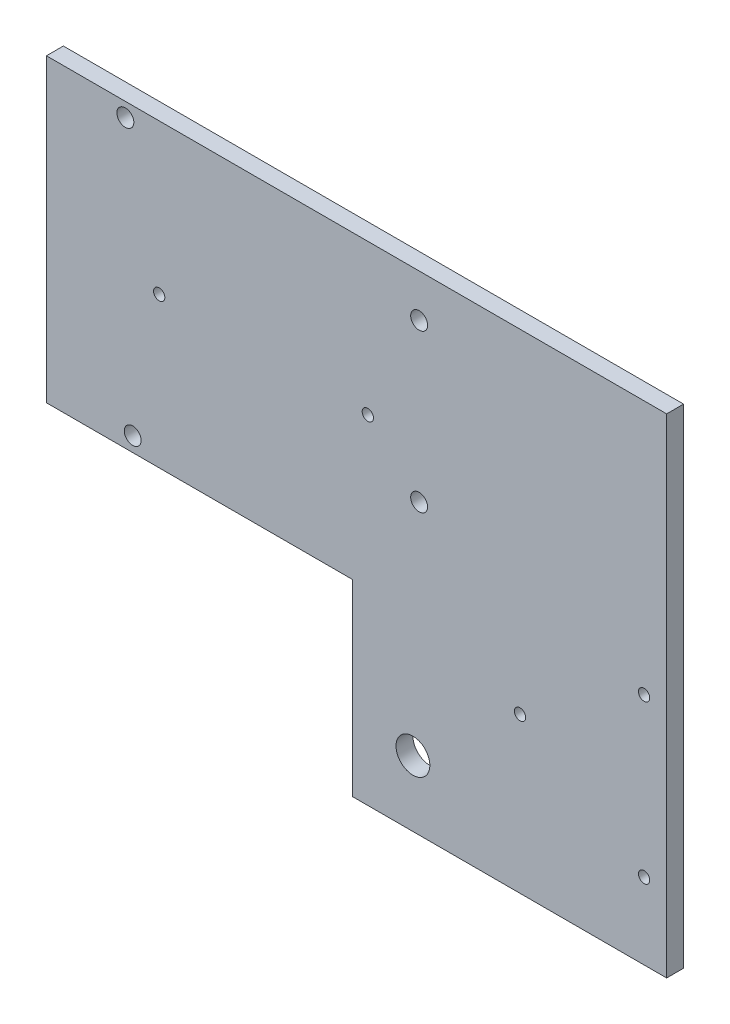
ISO-10303-21;
HEADER;
FILE_DESCRIPTION(('STEP AP214'),'2;1');
FILE_NAME('part.step','',(''),(''),'','','');
FILE_SCHEMA(('AUTOMOTIVE_DESIGN { 1 0 10303 214 1 1 1 1 }'));
ENDSEC;
DATA;
#1=APPLICATION_CONTEXT('core data for automotive mechanical design processes');
#2=APPLICATION_PROTOCOL_DEFINITION('international standard','automotive_design',2000,#1);
#3=PRODUCT_CONTEXT('',#1,'mechanical');
#4=PRODUCT('Part','Part','',(#3));
#5=PRODUCT_RELATED_PRODUCT_CATEGORY('part','',(#4));
#6=PRODUCT_DEFINITION_FORMATION('','',#4);
#7=PRODUCT_DEFINITION_CONTEXT('part definition',#1,'design');
#8=PRODUCT_DEFINITION('design','',#6,#7);
#9=PRODUCT_DEFINITION_SHAPE('','',#8);
#10=(LENGTH_UNIT() NAMED_UNIT(*) SI_UNIT(.MILLI.,.METRE.));
#11=(NAMED_UNIT(*) PLANE_ANGLE_UNIT() SI_UNIT($,.RADIAN.));
#12=(NAMED_UNIT(*) SI_UNIT($,.STERADIAN.) SOLID_ANGLE_UNIT());
#13=UNCERTAINTY_MEASURE_WITH_UNIT(LENGTH_MEASURE(1.E-05),#10,'distance_accuracy_value','');
#14=(GEOMETRIC_REPRESENTATION_CONTEXT(3) GLOBAL_UNCERTAINTY_ASSIGNED_CONTEXT((#13)) GLOBAL_UNIT_ASSIGNED_CONTEXT((#10,
#11,#12)) REPRESENTATION_CONTEXT('',''));
#15=CARTESIAN_POINT('',(0.,0.,0.));
#16=DIRECTION('',(0.,0.,1.));
#17=DIRECTION('',(1.,0.,0.));
#18=AXIS2_PLACEMENT_3D('',#15,#16,#17);
#19=CARTESIAN_POINT('',(0.,0.,3.));
#20=DIRECTION('',(0.,0.,-1.));
#21=DIRECTION('',(-1.,0.,0.));
#22=AXIS2_PLACEMENT_3D('',#19,#20,#21);
#23=PLANE('',#22);
#24=DIRECTION('',(1.,0.,0.));
#25=VECTOR('',#24,1.);
#26=CARTESIAN_POINT('',(26.5899295763963,98.918134130357,3.));
#27=LINE('',#26,#25);
#28=CARTESIAN_POINT('',(26.5899295763963,98.918134130357,3.));
#29=VERTEX_POINT('',#28);
#30=CARTESIAN_POINT('',(136.589929576396,98.918134130357,3.));
#31=VERTEX_POINT('',#30);
#32=EDGE_CURVE('E391',#29,#31,#27,.T.);
#33=ORIENTED_EDGE('',*,*,#32,.F.);
#34=DIRECTION('',(0.,-1.,0.));
#35=VECTOR('',#34,1.);
#36=CARTESIAN_POINT('',(26.5899295763963,98.918134130357,3.));
#37=LINE('',#36,#35);
#38=CARTESIAN_POINT('',(26.5899295763963,45.6181341303578,3.));
#39=VERTEX_POINT('',#38);
#40=EDGE_CURVE('E346',#29,#39,#37,.T.);
#41=ORIENTED_EDGE('',*,*,#40,.T.);
#42=DIRECTION('',(1.,0.,0.));
#43=VECTOR('',#42,1.);
#44=CARTESIAN_POINT('',(26.5899295763963,45.6181341303578,3.));
#45=LINE('',#44,#43);
#46=CARTESIAN_POINT('',(80.8899295763956,45.6181341303578,3.));
#47=VERTEX_POINT('',#46);
#48=EDGE_CURVE('E338',#39,#47,#45,.T.);
#49=ORIENTED_EDGE('',*,*,#48,.T.);
#50=DIRECTION('',(0.,1.,0.));
#51=VECTOR('',#50,1.);
#52=CARTESIAN_POINT('',(80.8899295763956,12.2681341303574,3.));
#53=LINE('',#52,#51);
#54=CARTESIAN_POINT('',(80.8899295763956,12.2681341303574,3.));
#55=VERTEX_POINT('',#54);
#56=EDGE_CURVE('E344',#55,#47,#53,.T.);
#57=ORIENTED_EDGE('',*,*,#56,.F.);
#58=DIRECTION('',(-1.,0.,0.));
#59=VECTOR('',#58,1.);
#60=CARTESIAN_POINT('',(136.589929576396,12.2681341303574,3.));
#61=LINE('',#60,#59);
#62=CARTESIAN_POINT('',(136.589929576396,12.2681341303574,3.));
#63=VERTEX_POINT('',#62);
#64=EDGE_CURVE('E363',#63,#55,#61,.T.);
#65=ORIENTED_EDGE('',*,*,#64,.F.);
#66=DIRECTION('',(0.,-1.,0.));
#67=VECTOR('',#66,1.);
#68=CARTESIAN_POINT('',(136.589929576396,98.918134130357,3.));
#69=LINE('',#68,#67);
#70=EDGE_CURVE('E366',#31,#63,#69,.T.);
#71=ORIENTED_EDGE('',*,*,#70,.F.);
#72=EDGE_LOOP('',(#33,#41,#49,#57,#65,#71));
#73=FACE_BOUND('',#72,.T.);
#74=CARTESIAN_POINT('',(40.5899295763963,96.418134130357,3.));
#75=DIRECTION('',(0.,0.,1.));
#76=DIRECTION('',(1.,0.,0.));
#77=AXIS2_PLACEMENT_3D('',#74,#75,#76);
#78=CIRCLE('',#77,1.5);
#79=CARTESIAN_POINT('',(42.0899295763963,96.418134130357,3.));
#80=VERTEX_POINT('',#79);
#81=EDGE_CURVE('E377',#80,#80,#78,.T.);
#82=ORIENTED_EDGE('',*,*,#81,.F.);
#83=EDGE_LOOP('',(#82));
#84=FACE_BOUND('',#83,.T.);
#85=CARTESIAN_POINT('',(46.5899295763963,72.2681341303574,3.));
#86=DIRECTION('',(0.,0.,1.));
#87=DIRECTION('',(1.,0.,0.));
#88=AXIS2_PLACEMENT_3D('',#85,#86,#87);
#89=CIRCLE('',#88,1.);
#90=CARTESIAN_POINT('',(47.5899295763963,72.2681341303574,3.));
#91=VERTEX_POINT('',#90);
#92=EDGE_CURVE('E414',#91,#91,#89,.T.);
#93=ORIENTED_EDGE('',*,*,#92,.F.);
#94=EDGE_LOOP('',(#93));
#95=FACE_BOUND('',#94,.T.);
#96=CARTESIAN_POINT('',(41.8899295763993,48.2181341303581,3.));
#97=DIRECTION('',(0.,0.,1.));
#98=DIRECTION('',(1.,0.,0.));
#99=AXIS2_PLACEMENT_3D('',#96,#97,#98);
#100=CIRCLE('',#99,1.5);
#101=CARTESIAN_POINT('',(43.3899295763993,48.2181341303581,3.));
#102=VERTEX_POINT('',#101);
#103=EDGE_CURVE('E422',#102,#102,#100,.T.);
#104=ORIENTED_EDGE('',*,*,#103,.F.);
#105=EDGE_LOOP('',(#104));
#106=FACE_BOUND('',#105,.T.);
#107=CARTESIAN_POINT('',(83.5899295763963,72.2681341303574,3.));
#108=DIRECTION('',(0.,0.,1.));
#109=DIRECTION('',(1.,0.,0.));
#110=AXIS2_PLACEMENT_3D('',#107,#108,#109);
#111=CIRCLE('',#110,1.);
#112=CARTESIAN_POINT('',(84.5899295763963,72.2681341303574,3.));
#113=VERTEX_POINT('',#112);
#114=EDGE_CURVE('E430',#113,#113,#111,.T.);
#115=ORIENTED_EDGE('',*,*,#114,.F.);
#116=EDGE_LOOP('',(#115));
#117=FACE_BOUND('',#116,.T.);
#118=CARTESIAN_POINT('',(92.6899295763985,91.3181341303567,3.));
#119=DIRECTION('',(0.,0.,1.));
#120=DIRECTION('',(1.,0.,0.));
#121=AXIS2_PLACEMENT_3D('',#118,#119,#120);
#122=CIRCLE('',#121,1.5);
#123=CARTESIAN_POINT('',(94.1899295763985,91.3181341303567,3.));
#124=VERTEX_POINT('',#123);
#125=EDGE_CURVE('E438',#124,#124,#122,.T.);
#126=ORIENTED_EDGE('',*,*,#125,.F.);
#127=EDGE_LOOP('',(#126));
#128=FACE_BOUND('',#127,.T.);
#129=CARTESIAN_POINT('',(92.6899295763985,63.418134130357,3.));
#130=DIRECTION('',(0.,0.,1.));
#131=DIRECTION('',(1.,0.,0.));
#132=AXIS2_PLACEMENT_3D('',#129,#130,#131);
#133=CIRCLE('',#132,1.5);
#134=CARTESIAN_POINT('',(94.1899295763985,63.418134130357,3.));
#135=VERTEX_POINT('',#134);
#136=EDGE_CURVE('E446',#135,#135,#133,.T.);
#137=ORIENTED_EDGE('',*,*,#136,.F.);
#138=EDGE_LOOP('',(#137));
#139=FACE_BOUND('',#138,.T.);
#140=CARTESIAN_POINT('',(110.589929576396,39.7681341303574,3.));
#141=DIRECTION('',(0.,0.,1.));
#142=DIRECTION('',(1.,0.,0.));
#143=AXIS2_PLACEMENT_3D('',#140,#141,#142);
#144=CIRCLE('',#143,1.);
#145=CARTESIAN_POINT('',(111.589929576396,39.7681341303574,3.));
#146=VERTEX_POINT('',#145);
#147=EDGE_CURVE('E454',#146,#146,#144,.T.);
#148=ORIENTED_EDGE('',*,*,#147,.F.);
#149=EDGE_LOOP('',(#148));
#150=FACE_BOUND('',#149,.T.);
#151=CARTESIAN_POINT('',(132.589929576396,53.7681341303556,3.));
#152=DIRECTION('',(0.,0.,1.));
#153=DIRECTION('',(1.,0.,0.));
#154=AXIS2_PLACEMENT_3D('',#151,#152,#153);
#155=CIRCLE('',#154,1.);
#156=CARTESIAN_POINT('',(133.589929576396,53.7681341303556,3.));
#157=VERTEX_POINT('',#156);
#158=EDGE_CURVE('E462',#157,#157,#155,.T.);
#159=ORIENTED_EDGE('',*,*,#158,.F.);
#160=EDGE_LOOP('',(#159));
#161=FACE_BOUND('',#160,.T.);
#162=CARTESIAN_POINT('',(91.5899295763963,23.918134130357,3.));
#163=DIRECTION('',(0.,0.,1.));
#164=DIRECTION('',(1.,0.,0.));
#165=AXIS2_PLACEMENT_3D('',#162,#163,#164);
#166=CIRCLE('',#165,3.);
#167=CARTESIAN_POINT('',(94.5899295763963,23.918134130357,3.));
#168=VERTEX_POINT('',#167);
#169=EDGE_CURVE('E470',#168,#168,#166,.T.);
#170=ORIENTED_EDGE('',*,*,#169,.F.);
#171=EDGE_LOOP('',(#170));
#172=FACE_BOUND('',#171,.T.);
#173=CARTESIAN_POINT('',(132.589929576396,25.7681341303556,3.));
#174=DIRECTION('',(0.,0.,1.));
#175=DIRECTION('',(1.,0.,0.));
#176=AXIS2_PLACEMENT_3D('',#173,#174,#175);
#177=CIRCLE('',#176,1.);
#178=CARTESIAN_POINT('',(133.589929576396,25.7681341303556,3.));
#179=VERTEX_POINT('',#178);
#180=EDGE_CURVE('E478',#179,#179,#177,.T.);
#181=ORIENTED_EDGE('',*,*,#180,.F.);
#182=EDGE_LOOP('',(#181));
#183=FACE_BOUND('',#182,.T.);
#184=ADVANCED_FACE('F279',(#73,#84,#95,#106,#117,#128,#139,#150,#161,#172,#183),#23,.F.);
#185=CARTESIAN_POINT('',(0.,0.,0.));
#186=DIRECTION('',(0.,0.,-1.));
#187=DIRECTION('',(-1.,0.,0.));
#188=AXIS2_PLACEMENT_3D('',#185,#186,#187);
#189=PLANE('',#188);
#190=CARTESIAN_POINT('',(91.5899295763963,23.918134130357,0.));
#191=DIRECTION('',(0.,0.,1.));
#192=DIRECTION('',(1.,0.,0.));
#193=AXIS2_PLACEMENT_3D('',#190,#191,#192);
#194=CIRCLE('',#193,3.);
#195=CARTESIAN_POINT('',(94.5899295763963,23.918134130357,0.));
#196=VERTEX_POINT('',#195);
#197=EDGE_CURVE('E474',#196,#196,#194,.T.);
#198=ORIENTED_EDGE('',*,*,#197,.T.);
#199=EDGE_LOOP('',(#198));
#200=FACE_BOUND('',#199,.T.);
#201=CARTESIAN_POINT('',(110.589929576396,39.7681341303574,0.));
#202=DIRECTION('',(0.,0.,1.));
#203=DIRECTION('',(1.,0.,0.));
#204=AXIS2_PLACEMENT_3D('',#201,#202,#203);
#205=CIRCLE('',#204,1.);
#206=CARTESIAN_POINT('',(111.589929576396,39.7681341303574,0.));
#207=VERTEX_POINT('',#206);
#208=EDGE_CURVE('E458',#207,#207,#205,.T.);
#209=ORIENTED_EDGE('',*,*,#208,.T.);
#210=EDGE_LOOP('',(#209));
#211=FACE_BOUND('',#210,.T.);
#212=CARTESIAN_POINT('',(92.6899295763985,91.3181341303567,0.));
#213=DIRECTION('',(0.,0.,1.));
#214=DIRECTION('',(1.,0.,0.));
#215=AXIS2_PLACEMENT_3D('',#212,#213,#214);
#216=CIRCLE('',#215,1.5);
#217=CARTESIAN_POINT('',(94.1899295763985,91.3181341303567,0.));
#218=VERTEX_POINT('',#217);
#219=EDGE_CURVE('E442',#218,#218,#216,.T.);
#220=ORIENTED_EDGE('',*,*,#219,.T.);
#221=EDGE_LOOP('',(#220));
#222=FACE_BOUND('',#221,.T.);
#223=CARTESIAN_POINT('',(41.8899295763993,48.2181341303581,0.));
#224=DIRECTION('',(0.,0.,1.));
#225=DIRECTION('',(1.,0.,0.));
#226=AXIS2_PLACEMENT_3D('',#223,#224,#225);
#227=CIRCLE('',#226,1.5);
#228=CARTESIAN_POINT('',(43.3899295763993,48.2181341303581,0.));
#229=VERTEX_POINT('',#228);
#230=EDGE_CURVE('E426',#229,#229,#227,.T.);
#231=ORIENTED_EDGE('',*,*,#230,.T.);
#232=EDGE_LOOP('',(#231));
#233=FACE_BOUND('',#232,.T.);
#234=CARTESIAN_POINT('',(40.5899295763963,96.418134130357,0.));
#235=DIRECTION('',(0.,0.,1.));
#236=DIRECTION('',(1.,0.,0.));
#237=AXIS2_PLACEMENT_3D('',#234,#235,#236);
#238=CIRCLE('',#237,1.5);
#239=CARTESIAN_POINT('',(42.0899295763963,96.418134130357,0.));
#240=VERTEX_POINT('',#239);
#241=EDGE_CURVE('E410',#240,#240,#238,.T.);
#242=ORIENTED_EDGE('',*,*,#241,.T.);
#243=EDGE_LOOP('',(#242));
#244=FACE_BOUND('',#243,.T.);
#245=DIRECTION('',(1.,0.,0.));
#246=VECTOR('',#245,1.);
#247=CARTESIAN_POINT('',(26.5899295763963,98.918134130357,0.));
#248=LINE('',#247,#246);
#249=CARTESIAN_POINT('',(26.5899295763963,98.918134130357,0.));
#250=VERTEX_POINT('',#249);
#251=CARTESIAN_POINT('',(136.589929576396,98.918134130357,0.));
#252=VERTEX_POINT('',#251);
#253=EDGE_CURVE('E372',#250,#252,#248,.T.);
#254=ORIENTED_EDGE('',*,*,#253,.T.);
#255=DIRECTION('',(0.,-1.,0.));
#256=VECTOR('',#255,1.);
#257=CARTESIAN_POINT('',(136.589929576396,45.6181341303578,0.));
#258=LINE('',#257,#256);
#259=CARTESIAN_POINT('',(136.589929576396,12.2681341303574,0.));
#260=VERTEX_POINT('',#259);
#261=EDGE_CURVE('E376',#252,#260,#258,.T.);
#262=ORIENTED_EDGE('',*,*,#261,.T.);
#263=DIRECTION('',(-1.,0.,0.));
#264=VECTOR('',#263,1.);
#265=CARTESIAN_POINT('',(136.589929576396,12.2681341303574,0.));
#266=LINE('',#265,#264);
#267=CARTESIAN_POINT('',(80.8899295763956,12.2681341303574,0.));
#268=VERTEX_POINT('',#267);
#269=EDGE_CURVE('E381',#260,#268,#266,.T.);
#270=ORIENTED_EDGE('',*,*,#269,.T.);
#271=DIRECTION('',(0.,1.,0.));
#272=VECTOR('',#271,1.);
#273=CARTESIAN_POINT('',(80.8899295763956,12.2681341303574,0.));
#274=LINE('',#273,#272);
#275=CARTESIAN_POINT('',(80.8899295763956,45.6181341303578,0.));
#276=VERTEX_POINT('',#275);
#277=EDGE_CURVE('E385',#268,#276,#274,.T.);
#278=ORIENTED_EDGE('',*,*,#277,.T.);
#279=DIRECTION('',(1.,0.,0.));
#280=VECTOR('',#279,1.);
#281=CARTESIAN_POINT('',(26.5899295763963,45.6181341303578,0.));
#282=LINE('',#281,#280);
#283=CARTESIAN_POINT('',(26.5899295763963,45.6181341303578,0.));
#284=VERTEX_POINT('',#283);
#285=EDGE_CURVE('E354',#284,#276,#282,.T.);
#286=ORIENTED_EDGE('',*,*,#285,.F.);
#287=DIRECTION('',(0.,-1.,0.));
#288=VECTOR('',#287,1.);
#289=CARTESIAN_POINT('',(26.5899295763963,98.918134130357,0.));
#290=LINE('',#289,#288);
#291=EDGE_CURVE('E320',#250,#284,#290,.T.);
#292=ORIENTED_EDGE('',*,*,#291,.F.);
#293=EDGE_LOOP('',(#254,#262,#270,#278,#286,#292));
#294=FACE_BOUND('',#293,.T.);
#295=CARTESIAN_POINT('',(46.5899295763963,72.2681341303574,0.));
#296=DIRECTION('',(0.,0.,1.));
#297=DIRECTION('',(1.,0.,0.));
#298=AXIS2_PLACEMENT_3D('',#295,#296,#297);
#299=CIRCLE('',#298,1.);
#300=CARTESIAN_POINT('',(47.5899295763963,72.2681341303574,0.));
#301=VERTEX_POINT('',#300);
#302=EDGE_CURVE('E418',#301,#301,#299,.T.);
#303=ORIENTED_EDGE('',*,*,#302,.T.);
#304=EDGE_LOOP('',(#303));
#305=FACE_BOUND('',#304,.T.);
#306=CARTESIAN_POINT('',(83.5899295763963,72.2681341303574,0.));
#307=DIRECTION('',(0.,0.,1.));
#308=DIRECTION('',(1.,0.,0.));
#309=AXIS2_PLACEMENT_3D('',#306,#307,#308);
#310=CIRCLE('',#309,1.);
#311=CARTESIAN_POINT('',(84.5899295763963,72.2681341303574,0.));
#312=VERTEX_POINT('',#311);
#313=EDGE_CURVE('E434',#312,#312,#310,.T.);
#314=ORIENTED_EDGE('',*,*,#313,.T.);
#315=EDGE_LOOP('',(#314));
#316=FACE_BOUND('',#315,.T.);
#317=CARTESIAN_POINT('',(92.6899295763985,63.418134130357,0.));
#318=DIRECTION('',(0.,0.,1.));
#319=DIRECTION('',(1.,0.,0.));
#320=AXIS2_PLACEMENT_3D('',#317,#318,#319);
#321=CIRCLE('',#320,1.5);
#322=CARTESIAN_POINT('',(94.1899295763985,63.418134130357,0.));
#323=VERTEX_POINT('',#322);
#324=EDGE_CURVE('E450',#323,#323,#321,.T.);
#325=ORIENTED_EDGE('',*,*,#324,.T.);
#326=EDGE_LOOP('',(#325));
#327=FACE_BOUND('',#326,.T.);
#328=CARTESIAN_POINT('',(132.589929576396,53.7681341303556,0.));
#329=DIRECTION('',(0.,0.,1.));
#330=DIRECTION('',(1.,0.,0.));
#331=AXIS2_PLACEMENT_3D('',#328,#329,#330);
#332=CIRCLE('',#331,1.);
#333=CARTESIAN_POINT('',(133.589929576396,53.7681341303556,0.));
#334=VERTEX_POINT('',#333);
#335=EDGE_CURVE('E466',#334,#334,#332,.T.);
#336=ORIENTED_EDGE('',*,*,#335,.T.);
#337=EDGE_LOOP('',(#336));
#338=FACE_BOUND('',#337,.T.);
#339=CARTESIAN_POINT('',(132.589929576396,25.7681341303556,0.));
#340=DIRECTION('',(0.,0.,1.));
#341=DIRECTION('',(1.,0.,0.));
#342=AXIS2_PLACEMENT_3D('',#339,#340,#341);
#343=CIRCLE('',#342,1.);
#344=CARTESIAN_POINT('',(133.589929576396,25.7681341303556,0.));
#345=VERTEX_POINT('',#344);
#346=EDGE_CURVE('E482',#345,#345,#343,.T.);
#347=ORIENTED_EDGE('',*,*,#346,.T.);
#348=EDGE_LOOP('',(#347));
#349=FACE_BOUND('',#348,.T.);
#350=ADVANCED_FACE('F402',(#200,#211,#222,#233,#244,#294,#305,#316,#327,#338,#349),#189,.T.);
#351=CARTESIAN_POINT('',(26.5899295763963,98.918134130357,3.));
#352=DIRECTION('',(0.,1.,0.));
#353=DIRECTION('',(0.,0.,1.));
#354=AXIS2_PLACEMENT_3D('',#351,#352,#353);
#355=PLANE('',#354);
#356=ORIENTED_EDGE('',*,*,#253,.F.);
#357=DIRECTION('',(0.,0.,-1.));
#358=VECTOR('',#357,1.);
#359=CARTESIAN_POINT('',(26.5899295763963,98.918134130357,3.));
#360=LINE('',#359,#358);
#361=EDGE_CURVE('E12',#29,#250,#360,.T.);
#362=ORIENTED_EDGE('',*,*,#361,.F.);
#363=ORIENTED_EDGE('',*,*,#32,.T.);
#364=DIRECTION('',(0.,0.,-1.));
#365=VECTOR('',#364,1.);
#366=CARTESIAN_POINT('',(136.589929576396,98.918134130357,3.));
#367=LINE('',#366,#365);
#368=EDGE_CURVE('E283',#31,#252,#367,.T.);
#369=ORIENTED_EDGE('',*,*,#368,.T.);
#370=EDGE_LOOP('',(#356,#362,#363,#369));
#371=FACE_BOUND('',#370,.T.);
#372=ADVANCED_FACE('F281',(#371),#355,.T.);
#373=CARTESIAN_POINT('',(26.5899295763963,98.918134130357,3.));
#374=DIRECTION('',(1.,0.,0.));
#375=DIRECTION('',(0.,0.,-1.));
#376=AXIS2_PLACEMENT_3D('',#373,#374,#375);
#377=PLANE('',#376);
#378=ORIENTED_EDGE('',*,*,#291,.T.);
#379=DIRECTION('',(0.,0.,-1.));
#380=VECTOR('',#379,1.);
#381=CARTESIAN_POINT('',(26.5899295763963,45.6181341303578,3.));
#382=LINE('',#381,#380);
#383=EDGE_CURVE('E290',#39,#284,#382,.T.);
#384=ORIENTED_EDGE('',*,*,#383,.F.);
#385=ORIENTED_EDGE('',*,*,#40,.F.);
#386=ORIENTED_EDGE('',*,*,#361,.T.);
#387=EDGE_LOOP('',(#378,#384,#385,#386));
#388=FACE_BOUND('',#387,.T.);
#389=ADVANCED_FACE('F504',(#388),#377,.F.);
#390=CARTESIAN_POINT('',(26.5899295763963,45.6181341303578,3.));
#391=DIRECTION('',(0.,1.,0.));
#392=DIRECTION('',(0.,0.,1.));
#393=AXIS2_PLACEMENT_3D('',#390,#391,#392);
#394=PLANE('',#393);
#395=ORIENTED_EDGE('',*,*,#285,.T.);
#396=DIRECTION('',(0.,0.,-1.));
#397=VECTOR('',#396,1.);
#398=CARTESIAN_POINT('',(80.8899295763956,45.6181341303578,3.));
#399=LINE('',#398,#397);
#400=EDGE_CURVE('E351',#47,#276,#399,.T.);
#401=ORIENTED_EDGE('',*,*,#400,.F.);
#402=ORIENTED_EDGE('',*,*,#48,.F.);
#403=ORIENTED_EDGE('',*,*,#383,.T.);
#404=EDGE_LOOP('',(#395,#401,#402,#403));
#405=FACE_BOUND('',#404,.T.);
#406=ADVANCED_FACE('F352',(#405),#394,.F.);
#407=CARTESIAN_POINT('',(80.8899295763956,12.2681341303574,3.));
#408=DIRECTION('',(-1.,0.,0.));
#409=DIRECTION('',(0.,0.,1.));
#410=AXIS2_PLACEMENT_3D('',#407,#408,#409);
#411=PLANE('',#410);
#412=ORIENTED_EDGE('',*,*,#277,.F.);
#413=DIRECTION('',(0.,0.,-1.));
#414=VECTOR('',#413,1.);
#415=CARTESIAN_POINT('',(80.8899295763956,12.2681341303574,3.));
#416=LINE('',#415,#414);
#417=EDGE_CURVE('E359',#55,#268,#416,.T.);
#418=ORIENTED_EDGE('',*,*,#417,.F.);
#419=ORIENTED_EDGE('',*,*,#56,.T.);
#420=ORIENTED_EDGE('',*,*,#400,.T.);
#421=EDGE_LOOP('',(#412,#418,#419,#420));
#422=FACE_BOUND('',#421,.T.);
#423=ADVANCED_FACE('F361',(#422),#411,.T.);
#424=CARTESIAN_POINT('',(136.589929576396,12.2681341303574,3.));
#425=DIRECTION('',(0.,-1.,0.));
#426=DIRECTION('',(0.,0.,-1.));
#427=AXIS2_PLACEMENT_3D('',#424,#425,#426);
#428=PLANE('',#427);
#429=ORIENTED_EDGE('',*,*,#269,.F.);
#430=DIRECTION('',(0.,0.,-1.));
#431=VECTOR('',#430,1.);
#432=CARTESIAN_POINT('',(136.589929576396,12.2681341303574,3.));
#433=LINE('',#432,#431);
#434=EDGE_CURVE('E396',#63,#260,#433,.T.);
#435=ORIENTED_EDGE('',*,*,#434,.F.);
#436=ORIENTED_EDGE('',*,*,#64,.T.);
#437=ORIENTED_EDGE('',*,*,#417,.T.);
#438=EDGE_LOOP('',(#429,#435,#436,#437));
#439=FACE_BOUND('',#438,.T.);
#440=ADVANCED_FACE('F405',(#439),#428,.T.);
#441=CARTESIAN_POINT('',(136.589929576396,45.6181341303578,3.));
#442=DIRECTION('',(1.,0.,0.));
#443=DIRECTION('',(0.,0.,-1.));
#444=AXIS2_PLACEMENT_3D('',#441,#442,#443);
#445=PLANE('',#444);
#446=ORIENTED_EDGE('',*,*,#261,.F.);
#447=ORIENTED_EDGE('',*,*,#368,.F.);
#448=ORIENTED_EDGE('',*,*,#70,.T.);
#449=ORIENTED_EDGE('',*,*,#434,.T.);
#450=EDGE_LOOP('',(#446,#447,#448,#449));
#451=FACE_BOUND('',#450,.T.);
#452=ADVANCED_FACE('F512',(#451),#445,.T.);
#453=CARTESIAN_POINT('',(40.5899295763963,96.418134130357,3.));
#454=DIRECTION('',(0.,0.,-1.));
#455=DIRECTION('',(-1.,0.,0.));
#456=AXIS2_PLACEMENT_3D('',#453,#454,#455);
#457=CYLINDRICAL_SURFACE('',#456,1.5);
#458=ORIENTED_EDGE('',*,*,#81,.T.);
#459=EDGE_LOOP('',(#458));
#460=FACE_BOUND('',#459,.T.);
#461=ORIENTED_EDGE('',*,*,#241,.F.);
#462=EDGE_LOOP('',(#461));
#463=FACE_BOUND('',#462,.T.);
#464=ADVANCED_FACE('F501',(#460,#463),#457,.F.);
#465=CARTESIAN_POINT('',(46.5899295763963,72.2681341303574,3.));
#466=DIRECTION('',(0.,0.,-1.));
#467=DIRECTION('',(-1.,0.,0.));
#468=AXIS2_PLACEMENT_3D('',#465,#466,#467);
#469=CYLINDRICAL_SURFACE('',#468,1.);
#470=ORIENTED_EDGE('',*,*,#92,.T.);
#471=EDGE_LOOP('',(#470));
#472=FACE_BOUND('',#471,.T.);
#473=ORIENTED_EDGE('',*,*,#302,.F.);
#474=EDGE_LOOP('',(#473));
#475=FACE_BOUND('',#474,.T.);
#476=ADVANCED_FACE('F517',(#472,#475),#469,.F.);
#477=CARTESIAN_POINT('',(41.8899295763993,48.2181341303581,3.));
#478=DIRECTION('',(0.,0.,-1.));
#479=DIRECTION('',(-1.,0.,0.));
#480=AXIS2_PLACEMENT_3D('',#477,#478,#479);
#481=CYLINDRICAL_SURFACE('',#480,1.5);
#482=ORIENTED_EDGE('',*,*,#103,.T.);
#483=EDGE_LOOP('',(#482));
#484=FACE_BOUND('',#483,.T.);
#485=ORIENTED_EDGE('',*,*,#230,.F.);
#486=EDGE_LOOP('',(#485));
#487=FACE_BOUND('',#486,.T.);
#488=ADVANCED_FACE('F522',(#484,#487),#481,.F.);
#489=CARTESIAN_POINT('',(83.5899295763963,72.2681341303574,3.));
#490=DIRECTION('',(0.,0.,-1.));
#491=DIRECTION('',(-1.,0.,0.));
#492=AXIS2_PLACEMENT_3D('',#489,#490,#491);
#493=CYLINDRICAL_SURFACE('',#492,1.);
#494=ORIENTED_EDGE('',*,*,#114,.T.);
#495=EDGE_LOOP('',(#494));
#496=FACE_BOUND('',#495,.T.);
#497=ORIENTED_EDGE('',*,*,#313,.F.);
#498=EDGE_LOOP('',(#497));
#499=FACE_BOUND('',#498,.T.);
#500=ADVANCED_FACE('F559',(#496,#499),#493,.F.);
#501=CARTESIAN_POINT('',(92.6899295763985,91.3181341303567,3.));
#502=DIRECTION('',(0.,0.,-1.));
#503=DIRECTION('',(-1.,0.,0.));
#504=AXIS2_PLACEMENT_3D('',#501,#502,#503);
#505=CYLINDRICAL_SURFACE('',#504,1.5);
#506=ORIENTED_EDGE('',*,*,#125,.T.);
#507=EDGE_LOOP('',(#506));
#508=FACE_BOUND('',#507,.T.);
#509=ORIENTED_EDGE('',*,*,#219,.F.);
#510=EDGE_LOOP('',(#509));
#511=FACE_BOUND('',#510,.T.);
#512=ADVANCED_FACE('F565',(#508,#511),#505,.F.);
#513=CARTESIAN_POINT('',(92.6899295763985,63.418134130357,3.));
#514=DIRECTION('',(0.,0.,-1.));
#515=DIRECTION('',(-1.,0.,0.));
#516=AXIS2_PLACEMENT_3D('',#513,#514,#515);
#517=CYLINDRICAL_SURFACE('',#516,1.5);
#518=ORIENTED_EDGE('',*,*,#136,.T.);
#519=EDGE_LOOP('',(#518));
#520=FACE_BOUND('',#519,.T.);
#521=ORIENTED_EDGE('',*,*,#324,.F.);
#522=EDGE_LOOP('',(#521));
#523=FACE_BOUND('',#522,.T.);
#524=ADVANCED_FACE('F571',(#520,#523),#517,.F.);
#525=CARTESIAN_POINT('',(110.589929576396,39.7681341303574,3.));
#526=DIRECTION('',(0.,0.,-1.));
#527=DIRECTION('',(-1.,0.,0.));
#528=AXIS2_PLACEMENT_3D('',#525,#526,#527);
#529=CYLINDRICAL_SURFACE('',#528,1.);
#530=ORIENTED_EDGE('',*,*,#147,.T.);
#531=EDGE_LOOP('',(#530));
#532=FACE_BOUND('',#531,.T.);
#533=ORIENTED_EDGE('',*,*,#208,.F.);
#534=EDGE_LOOP('',(#533));
#535=FACE_BOUND('',#534,.T.);
#536=ADVANCED_FACE('F575',(#532,#535),#529,.F.);
#537=CARTESIAN_POINT('',(132.589929576396,53.7681341303556,3.));
#538=DIRECTION('',(0.,0.,-1.));
#539=DIRECTION('',(-1.,0.,0.));
#540=AXIS2_PLACEMENT_3D('',#537,#538,#539);
#541=CYLINDRICAL_SURFACE('',#540,1.);
#542=ORIENTED_EDGE('',*,*,#158,.T.);
#543=EDGE_LOOP('',(#542));
#544=FACE_BOUND('',#543,.T.);
#545=ORIENTED_EDGE('',*,*,#335,.F.);
#546=EDGE_LOOP('',(#545));
#547=FACE_BOUND('',#546,.T.);
#548=ADVANCED_FACE('F548',(#544,#547),#541,.F.);
#549=CARTESIAN_POINT('',(91.5899295763963,23.918134130357,3.));
#550=DIRECTION('',(0.,0.,-1.));
#551=DIRECTION('',(-1.,0.,0.));
#552=AXIS2_PLACEMENT_3D('',#549,#550,#551);
#553=CYLINDRICAL_SURFACE('',#552,3.);
#554=ORIENTED_EDGE('',*,*,#169,.T.);
#555=EDGE_LOOP('',(#554));
#556=FACE_BOUND('',#555,.T.);
#557=ORIENTED_EDGE('',*,*,#197,.F.);
#558=EDGE_LOOP('',(#557));
#559=FACE_BOUND('',#558,.T.);
#560=ADVANCED_FACE('F545',(#556,#559),#553,.F.);
#561=CARTESIAN_POINT('',(132.589929576396,25.7681341303556,3.));
#562=DIRECTION('',(0.,0.,-1.));
#563=DIRECTION('',(-1.,0.,0.));
#564=AXIS2_PLACEMENT_3D('',#561,#562,#563);
#565=CYLINDRICAL_SURFACE('',#564,1.);
#566=ORIENTED_EDGE('',*,*,#180,.T.);
#567=EDGE_LOOP('',(#566));
#568=FACE_BOUND('',#567,.T.);
#569=ORIENTED_EDGE('',*,*,#346,.F.);
#570=EDGE_LOOP('',(#569));
#571=FACE_BOUND('',#570,.T.);
#572=ADVANCED_FACE('F490',(#568,#571),#565,.F.);
#573=CLOSED_SHELL('',(#184,#350,#372,#389,#406,#423,#440,#452,#464,#476,#488,#500,#512,#524,
#536,#548,#560,#572));
#574=MANIFOLD_SOLID_BREP('B2',#573);
#575=ADVANCED_BREP_SHAPE_REPRESENTATION('',(#18,#574),#14);
#576=SHAPE_DEFINITION_REPRESENTATION(#9,#575);
ENDSEC;
END-ISO-10303-21;
